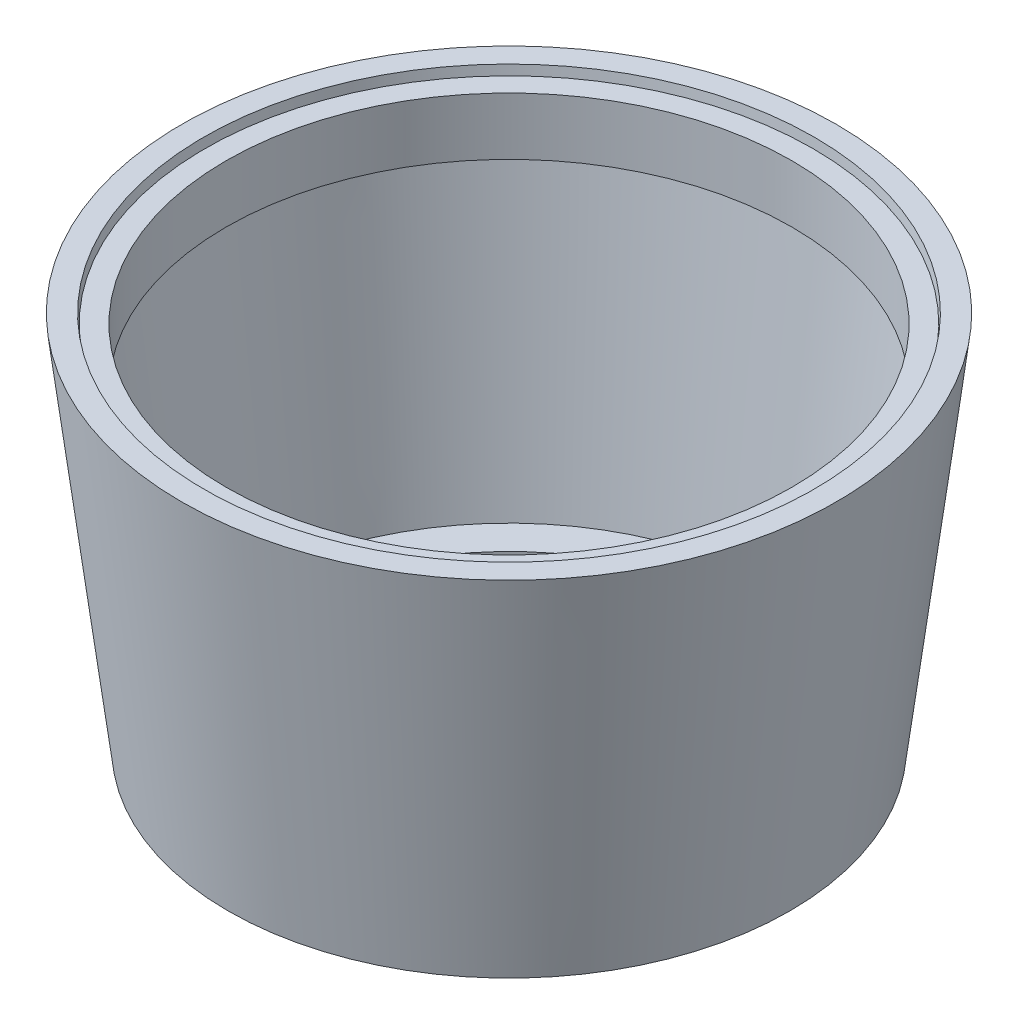
ISO-10303-21;
HEADER;
FILE_DESCRIPTION(('STEP AP214'),'2;1');
FILE_NAME('part.step','',(''),(''),'','','');
FILE_SCHEMA(('AUTOMOTIVE_DESIGN { 1 0 10303 214 1 1 1 1 }'));
ENDSEC;
DATA;
#1=APPLICATION_CONTEXT('core data for automotive mechanical design processes');
#2=APPLICATION_PROTOCOL_DEFINITION('international standard','automotive_design',2000,#1);
#3=PRODUCT_CONTEXT('',#1,'mechanical');
#4=PRODUCT('Part','Part','',(#3));
#5=PRODUCT_RELATED_PRODUCT_CATEGORY('part','',(#4));
#6=PRODUCT_DEFINITION_FORMATION('','',#4);
#7=PRODUCT_DEFINITION_CONTEXT('part definition',#1,'design');
#8=PRODUCT_DEFINITION('design','',#6,#7);
#9=PRODUCT_DEFINITION_SHAPE('','',#8);
#10=(LENGTH_UNIT() NAMED_UNIT(*) SI_UNIT(.MILLI.,.METRE.));
#11=(NAMED_UNIT(*) PLANE_ANGLE_UNIT() SI_UNIT($,.RADIAN.));
#12=(NAMED_UNIT(*) SI_UNIT($,.STERADIAN.) SOLID_ANGLE_UNIT());
#13=UNCERTAINTY_MEASURE_WITH_UNIT(LENGTH_MEASURE(1.E-05),#10,'distance_accuracy_value','');
#14=(GEOMETRIC_REPRESENTATION_CONTEXT(3) GLOBAL_UNCERTAINTY_ASSIGNED_CONTEXT((#13)) GLOBAL_UNIT_ASSIGNED_CONTEXT((#10,
#11,#12)) REPRESENTATION_CONTEXT('',''));
#15=CARTESIAN_POINT('',(0.,0.,0.));
#16=DIRECTION('',(0.,0.,1.));
#17=DIRECTION('',(1.,0.,0.));
#18=AXIS2_PLACEMENT_3D('',#15,#16,#17);
#19=CARTESIAN_POINT('',(-752.,0.,0.));
#20=DIRECTION('',(0.,-1.,0.));
#21=DIRECTION('',(0.,0.,-1.));
#22=AXIS2_PLACEMENT_3D('',#19,#20,#21);
#23=CYLINDRICAL_SURFACE('',#22,631.779869679297);
#24=CARTESIAN_POINT('',(-752.,0.,0.));
#25=DIRECTION('',(0.,-1.,0.));
#26=DIRECTION('',(0.,0.,-1.));
#27=AXIS2_PLACEMENT_3D('',#24,#25,#26);
#28=CIRCLE('',#27,631.779869679297);
#29=CARTESIAN_POINT('',(-752.,0.,-631.779869679297));
#30=VERTEX_POINT('',#29);
#31=EDGE_CURVE('E67',#30,#30,#28,.T.);
#32=ORIENTED_EDGE('',*,*,#31,.T.);
#33=EDGE_LOOP('',(#32));
#34=FACE_BOUND('',#33,.T.);
#35=CARTESIAN_POINT('',(-752.,14.,0.));
#36=DIRECTION('',(0.,-1.,0.));
#37=DIRECTION('',(0.,0.,-1.));
#38=AXIS2_PLACEMENT_3D('',#35,#36,#37);
#39=CIRCLE('',#38,631.779869679297);
#40=CARTESIAN_POINT('',(-752.,14.,-631.779869679297));
#41=VERTEX_POINT('',#40);
#42=EDGE_CURVE('E10',#41,#41,#39,.T.);
#43=ORIENTED_EDGE('',*,*,#42,.F.);
#44=EDGE_LOOP('',(#43));
#45=FACE_BOUND('',#44,.T.);
#46=ADVANCED_FACE('F33',(#34,#45),#23,.F.);
#47=CARTESIAN_POINT('',(-120.220130320703,14.,0.));
#48=DIRECTION('',(0.,1.,0.));
#49=DIRECTION('',(0.,0.,1.));
#50=AXIS2_PLACEMENT_3D('',#47,#48,#49);
#51=PLANE('',#50);
#52=ORIENTED_EDGE('',*,*,#42,.T.);
#53=EDGE_LOOP('',(#52));
#54=FACE_BOUND('',#53,.T.);
#55=CARTESIAN_POINT('',(-752.,14.,0.));
#56=DIRECTION('',(0.,-1.,0.));
#57=DIRECTION('',(0.,0.,-1.));
#58=AXIS2_PLACEMENT_3D('',#55,#56,#57);
#59=CIRCLE('',#58,725.284765454987);
#60=CARTESIAN_POINT('',(-752.,14.,-725.284765454987));
#61=VERTEX_POINT('',#60);
#62=EDGE_CURVE('E39',#61,#61,#59,.T.);
#63=ORIENTED_EDGE('',*,*,#62,.F.);
#64=EDGE_LOOP('',(#63));
#65=FACE_BOUND('',#64,.T.);
#66=ADVANCED_FACE('F85',(#54,#65),#51,.T.);
#67=CARTESIAN_POINT('',(-752.,836.737393315275,0.));
#68=DIRECTION('',(0.,1.,0.));
#69=DIRECTION('',(0.,0.,1.));
#70=AXIS2_PLACEMENT_3D('',#67,#68,#69);
#71=CONICAL_SURFACE('',#70,826.3042150316,0.1221730476396);
#72=ORIENTED_EDGE('',*,*,#62,.T.);
#73=EDGE_LOOP('',(#72));
#74=FACE_BOUND('',#73,.T.);
#75=CARTESIAN_POINT('',(-752.,836.737393315275,0.));
#76=DIRECTION('',(0.,-1.,0.));
#77=DIRECTION('',(0.,0.,-1.));
#78=AXIS2_PLACEMENT_3D('',#75,#76,#77);
#79=CIRCLE('',#78,826.3042150316);
#80=CARTESIAN_POINT('',(-752.,836.737393315275,-826.3042150316));
#81=VERTEX_POINT('',#80);
#82=EDGE_CURVE('E43',#81,#81,#79,.T.);
#83=ORIENTED_EDGE('',*,*,#82,.F.);
#84=EDGE_LOOP('',(#83));
#85=FACE_BOUND('',#84,.T.);
#86=ADVANCED_FACE('F89',(#74,#85),#71,.F.);
#87=CARTESIAN_POINT('',(10.4439954565834,836.737393315275,0.));
#88=DIRECTION('',(0.,-1.,0.));
#89=DIRECTION('',(0.,0.,-1.));
#90=AXIS2_PLACEMENT_3D('',#87,#88,#89);
#91=PLANE('',#90);
#92=ORIENTED_EDGE('',*,*,#82,.T.);
#93=EDGE_LOOP('',(#92));
#94=FACE_BOUND('',#93,.T.);
#95=CARTESIAN_POINT('',(-752.,836.737393315275,0.));
#96=DIRECTION('',(0.,-1.,0.));
#97=DIRECTION('',(0.,0.,-1.));
#98=AXIS2_PLACEMENT_3D('',#95,#96,#97);
#99=CIRCLE('',#98,762.443995456583);
#100=CARTESIAN_POINT('',(-752.,836.737393315275,-762.443995456583));
#101=VERTEX_POINT('',#100);
#102=EDGE_CURVE('E47',#101,#101,#99,.T.);
#103=ORIENTED_EDGE('',*,*,#102,.F.);
#104=EDGE_LOOP('',(#103));
#105=FACE_BOUND('',#104,.T.);
#106=ADVANCED_FACE('F93',(#94,#105),#91,.T.);
#107=CARTESIAN_POINT('',(-752.,0.,0.));
#108=DIRECTION('',(0.,-1.,0.));
#109=DIRECTION('',(0.,0.,-1.));
#110=AXIS2_PLACEMENT_3D('',#107,#108,#109);
#111=CYLINDRICAL_SURFACE('',#110,762.443995456583);
#112=ORIENTED_EDGE('',*,*,#102,.T.);
#113=EDGE_LOOP('',(#112));
#114=FACE_BOUND('',#113,.T.);
#115=CARTESIAN_POINT('',(-752.,991.619581866658,0.));
#116=DIRECTION('',(0.,-1.,0.));
#117=DIRECTION('',(0.,0.,-1.));
#118=AXIS2_PLACEMENT_3D('',#115,#116,#117);
#119=CIRCLE('',#118,762.443995456583);
#120=CARTESIAN_POINT('',(-752.,991.619581866658,-762.443995456583));
#121=VERTEX_POINT('',#120);
#122=EDGE_CURVE('E52',#121,#121,#119,.T.);
#123=ORIENTED_EDGE('',*,*,#122,.F.);
#124=EDGE_LOOP('',(#123));
#125=FACE_BOUND('',#124,.T.);
#126=ADVANCED_FACE('F99',(#114,#125),#111,.F.);
#127=CARTESIAN_POINT('',(67.1009082719421,991.619581866658,0.));
#128=DIRECTION('',(0.,1.,0.));
#129=DIRECTION('',(0.,0.,1.));
#130=AXIS2_PLACEMENT_3D('',#127,#128,#129);
#131=PLANE('',#130);
#132=ORIENTED_EDGE('',*,*,#122,.T.);
#133=EDGE_LOOP('',(#132));
#134=FACE_BOUND('',#133,.T.);
#135=CARTESIAN_POINT('',(-752.,991.619581866658,0.));
#136=DIRECTION('',(0.,-1.,0.));
#137=DIRECTION('',(0.,0.,-1.));
#138=AXIS2_PLACEMENT_3D('',#135,#136,#137);
#139=CIRCLE('',#138,819.100908271942);
#140=CARTESIAN_POINT('',(-752.,991.619581866658,-819.100908271942));
#141=VERTEX_POINT('',#140);
#142=EDGE_CURVE('E55',#141,#141,#139,.T.);
#143=ORIENTED_EDGE('',*,*,#142,.F.);
#144=EDGE_LOOP('',(#143));
#145=FACE_BOUND('',#144,.T.);
#146=ADVANCED_FACE('F103',(#134,#145),#131,.T.);
#147=CARTESIAN_POINT('',(-752.,1017.01842457511,0.));
#148=DIRECTION('',(0.,1.,0.));
#149=DIRECTION('',(0.,0.,1.));
#150=AXIS2_PLACEMENT_3D('',#147,#148,#149);
#151=CONICAL_SURFACE('',#150,822.219494021342,0.122173047639599);
#152=ORIENTED_EDGE('',*,*,#142,.T.);
#153=EDGE_LOOP('',(#152));
#154=FACE_BOUND('',#153,.T.);
#155=CARTESIAN_POINT('',(-752.,1017.01842457511,0.));
#156=DIRECTION('',(0.,-1.,0.));
#157=DIRECTION('',(0.,0.,-1.));
#158=AXIS2_PLACEMENT_3D('',#155,#156,#157);
#159=CIRCLE('',#158,822.219494021342);
#160=CARTESIAN_POINT('',(-752.,1017.01842457511,-822.219494021342));
#161=VERTEX_POINT('',#160);
#162=EDGE_CURVE('E58',#161,#161,#159,.T.);
#163=ORIENTED_EDGE('',*,*,#162,.F.);
#164=EDGE_LOOP('',(#163));
#165=FACE_BOUND('',#164,.T.);
#166=ADVANCED_FACE('F107',(#154,#165),#151,.F.);
#167=CARTESIAN_POINT('',(129.808523439056,1017.01842457511,0.));
#168=DIRECTION('',(0.,1.,0.));
#169=DIRECTION('',(0.,0.,1.));
#170=AXIS2_PLACEMENT_3D('',#167,#168,#169);
#171=PLANE('',#170);
#172=ORIENTED_EDGE('',*,*,#162,.T.);
#173=EDGE_LOOP('',(#172));
#174=FACE_BOUND('',#173,.T.);
#175=CARTESIAN_POINT('',(-752.,1017.01842457511,0.));
#176=DIRECTION('',(0.,-1.,0.));
#177=DIRECTION('',(0.,0.,-1.));
#178=AXIS2_PLACEMENT_3D('',#175,#176,#177);
#179=CIRCLE('',#178,881.808523439056);
#180=CARTESIAN_POINT('',(-752.,1017.01842457511,-881.808523439056));
#181=VERTEX_POINT('',#180);
#182=EDGE_CURVE('E61',#181,#181,#179,.T.);
#183=ORIENTED_EDGE('',*,*,#182,.F.);
#184=EDGE_LOOP('',(#183));
#185=FACE_BOUND('',#184,.T.);
#186=ADVANCED_FACE('F81',(#174,#185),#171,.T.);
#187=CARTESIAN_POINT('',(-752.,0.,0.));
#188=DIRECTION('',(0.,1.,0.));
#189=DIRECTION('',(0.,0.,1.));
#190=AXIS2_PLACEMENT_3D('',#187,#188,#189);
#191=CONICAL_SURFACE('',#190,756.934362747441,0.1221730476396);
#192=ORIENTED_EDGE('',*,*,#182,.T.);
#193=EDGE_LOOP('',(#192));
#194=FACE_BOUND('',#193,.T.);
#195=CARTESIAN_POINT('',(-752.,0.,0.));
#196=DIRECTION('',(0.,-1.,0.));
#197=DIRECTION('',(0.,0.,-1.));
#198=AXIS2_PLACEMENT_3D('',#195,#196,#197);
#199=CIRCLE('',#198,756.934362747441);
#200=CARTESIAN_POINT('',(-752.,0.,-756.934362747441));
#201=VERTEX_POINT('',#200);
#202=EDGE_CURVE('E64',#201,#201,#199,.T.);
#203=ORIENTED_EDGE('',*,*,#202,.F.);
#204=EDGE_LOOP('',(#203));
#205=FACE_BOUND('',#204,.T.);
#206=ADVANCED_FACE('F75',(#194,#205),#191,.T.);
#207=CARTESIAN_POINT('',(-120.220130320703,0.,0.));
#208=DIRECTION('',(0.,-1.,0.));
#209=DIRECTION('',(0.,0.,-1.));
#210=AXIS2_PLACEMENT_3D('',#207,#208,#209);
#211=PLANE('',#210);
#212=ORIENTED_EDGE('',*,*,#202,.T.);
#213=EDGE_LOOP('',(#212));
#214=FACE_BOUND('',#213,.T.);
#215=ORIENTED_EDGE('',*,*,#31,.F.);
#216=EDGE_LOOP('',(#215));
#217=FACE_BOUND('',#216,.T.);
#218=ADVANCED_FACE('F73',(#214,#217),#211,.T.);
#219=CLOSED_SHELL('',(#46,#66,#86,#106,#126,#146,#166,#186,#206,#218));
#220=MANIFOLD_SOLID_BREP('B2',#219);
#221=ADVANCED_BREP_SHAPE_REPRESENTATION('',(#18,#220),#14);
#222=SHAPE_DEFINITION_REPRESENTATION(#9,#221);
ENDSEC;
END-ISO-10303-21;
